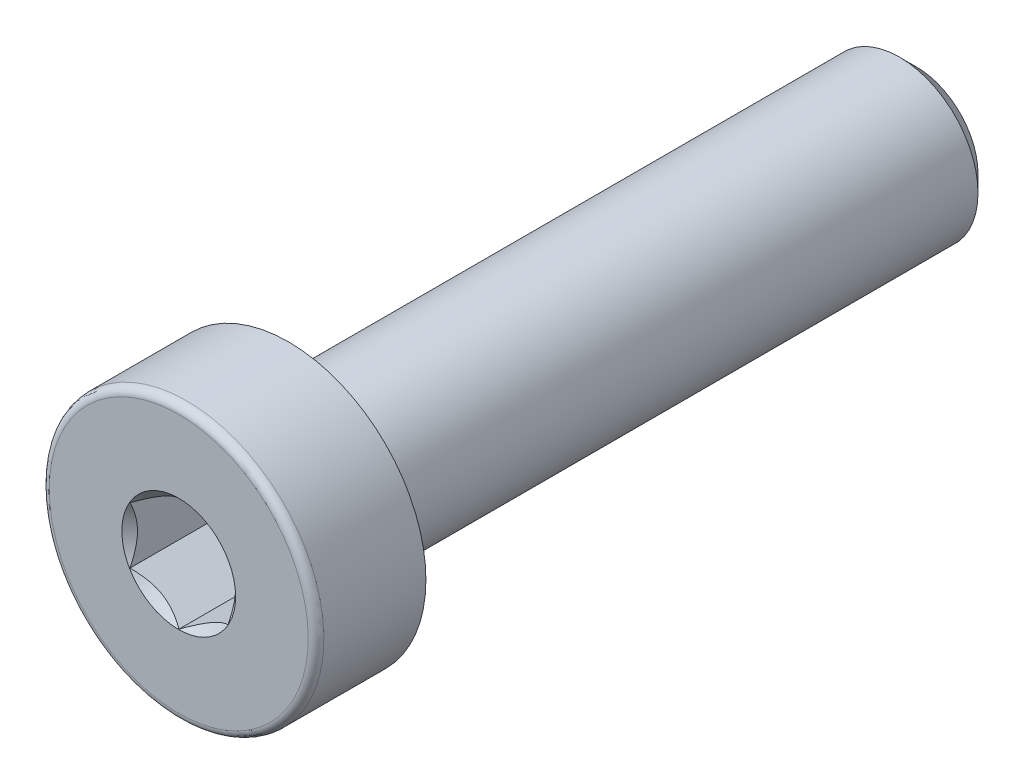
ISO-10303-21;
HEADER;
FILE_DESCRIPTION(('STEP AP214'),'2;1');
FILE_NAME('part.step','',(''),(''),'','','');
FILE_SCHEMA(('AUTOMOTIVE_DESIGN { 1 0 10303 214 1 1 1 1 }'));
ENDSEC;
DATA;
#1=APPLICATION_CONTEXT('core data for automotive mechanical design processes');
#2=APPLICATION_PROTOCOL_DEFINITION('international standard','automotive_design',2000,#1);
#3=PRODUCT_CONTEXT('',#1,'mechanical');
#4=PRODUCT('Part','Part','',(#3));
#5=PRODUCT_RELATED_PRODUCT_CATEGORY('part','',(#4));
#6=PRODUCT_DEFINITION_FORMATION('','',#4);
#7=PRODUCT_DEFINITION_CONTEXT('part definition',#1,'design');
#8=PRODUCT_DEFINITION('design','',#6,#7);
#9=PRODUCT_DEFINITION_SHAPE('','',#8);
#10=(LENGTH_UNIT() NAMED_UNIT(*) SI_UNIT(.MILLI.,.METRE.));
#11=(NAMED_UNIT(*) PLANE_ANGLE_UNIT() SI_UNIT($,.RADIAN.));
#12=(NAMED_UNIT(*) SI_UNIT($,.STERADIAN.) SOLID_ANGLE_UNIT());
#13=UNCERTAINTY_MEASURE_WITH_UNIT(LENGTH_MEASURE(1.E-05),#10,'distance_accuracy_value','');
#14=(GEOMETRIC_REPRESENTATION_CONTEXT(3) GLOBAL_UNCERTAINTY_ASSIGNED_CONTEXT((#13)) GLOBAL_UNIT_ASSIGNED_CONTEXT((#10,
#11,#12)) REPRESENTATION_CONTEXT('',''));
#15=CARTESIAN_POINT('',(0.,0.,0.));
#16=DIRECTION('',(0.,0.,1.));
#17=DIRECTION('',(1.,0.,0.));
#18=AXIS2_PLACEMENT_3D('',#15,#16,#17);
#19=CARTESIAN_POINT('',(12.1733937586588,8.47168783648703,11.6));
#20=DIRECTION('',(-1.,0.,0.));
#21=DIRECTION('',(0.,-1.,0.));
#22=AXIS2_PLACEMENT_3D('',#19,#20,#21);
#23=PLANE('',#22);
#24=DIRECTION('',(0.,0.,1.));
#25=VECTOR('',#24,1.);
#26=CARTESIAN_POINT('',(12.1733937586588,7.02831216351297,11.6));
#27=LINE('',#26,#25);
#28=CARTESIAN_POINT('',(12.1733936055537,7.02831205156453,11.5933758615089));
#29=VERTEX_POINT('',#28);
#30=CARTESIAN_POINT('',(12.1733937586588,7.02831216351297,9.3));
#31=VERTEX_POINT('',#30);
#32=EDGE_CURVE('E79',#29,#31,#27,.F.);
#33=ORIENTED_EDGE('',*,*,#32,.T.);
#34=DIRECTION('',(0.,-1.,0.));
#35=VECTOR('',#34,1.);
#36=CARTESIAN_POINT('',(12.1733937586588,8.47168783648703,9.3));
#37=LINE('',#36,#35);
#38=CARTESIAN_POINT('',(12.1733937586588,8.47168783648703,9.3));
#39=VERTEX_POINT('',#38);
#40=EDGE_CURVE('E85',#39,#31,#37,.T.);
#41=ORIENTED_EDGE('',*,*,#40,.F.);
#42=DIRECTION('',(0.,0.,1.));
#43=VECTOR('',#42,1.);
#44=CARTESIAN_POINT('',(12.1733937586588,8.47168783648703,11.6));
#45=LINE('',#44,#43);
#46=CARTESIAN_POINT('',(12.1733937586588,8.47168783649215,11.5933756729511));
#47=VERTEX_POINT('',#46);
#48=EDGE_CURVE('E82',#39,#47,#45,.T.);
#49=ORIENTED_EDGE('',*,*,#48,.T.);
#50=CARTESIAN_POINT('',(12.1733937331432,7.02831211077274,11.5933756853312));
#51=CARTESIAN_POINT('',(12.1733937494776,7.07792164231517,11.5685947292841));
#52=CARTESIAN_POINT('',(12.1733937561935,7.12836064770858,11.5452694390637));
#53=CARTESIAN_POINT('',(12.1733937611384,7.23121095441787,11.5025618251181));
#54=CARTESIAN_POINT('',(12.1733937593177,7.28363203145641,11.4832032561276));
#55=CARTESIAN_POINT('',(12.1733937580104,7.38933655588187,11.4500418936137));
#56=CARTESIAN_POINT('',(12.1733937584872,7.44259309812312,11.4361557728266));
#57=CARTESIAN_POINT('',(12.17339375883,7.55027832665406,11.4147615753697));
#58=CARTESIAN_POINT('',(12.1733937586975,7.60470372561001,11.4072375346613));
#59=CARTESIAN_POINT('',(12.1733937586311,7.69851085379618,11.4004485004952));
#60=CARTESIAN_POINT('',(12.1733937586514,7.73777152196755,11.3994438615368));
#61=CARTESIAN_POINT('',(12.1733937586662,7.81622375204068,11.4011391685543));
#62=CARTESIAN_POINT('',(12.1733937586608,7.85541529676245,11.4038399328631));
#63=CARTESIAN_POINT('',(12.1733937586568,7.93342000951447,11.4127899225568));
#64=CARTESIAN_POINT('',(12.1733937586583,7.9722327915118,11.4190424476048));
#65=CARTESIAN_POINT('',(12.1733937586593,8.04921033113919,11.4347592145066));
#66=CARTESIAN_POINT('',(12.173393758659,8.08737480331317,11.4442248344974));
#67=CARTESIAN_POINT('',(12.1733937586585,8.18507550237444,11.4723040074918));
#68=CARTESIAN_POINT('',(12.1733937586587,8.24399691925719,11.4930250205897));
#69=CARTESIAN_POINT('',(12.1733937586589,8.3595345412326,11.5396991802522));
#70=CARTESIAN_POINT('',(12.1733937586591,8.41615754724984,11.565635294969));
#71=CARTESIAN_POINT('',(12.1733937586588,8.47168783649727,11.5933756729536));
#72=B_SPLINE_CURVE_WITH_KNOTS('',3,(#50,#51,#52,#53,#54,#55,#56,#57,#58,#59,#60,#61,#62,#63,#64,
#65,#66,#67,#68,#69,#70,#71),.UNSPECIFIED.,.F.,.F.,(4,2,2,2,2,2,2,2,2,2,4),(0.,
0.166478697229374,0.333926955646074,0.498716702194594,0.663091712815436,0.780745635339157,
0.898425545737518,1.01621496255327,1.13405496470712,1.32111597483518,1.50757571066265),.UNSPECIFIED.);
#73=EDGE_CURVE('E76',#29,#47,#72,.T.);
#74=ORIENTED_EDGE('',*,*,#73,.F.);
#75=EDGE_LOOP('',(#33,#41,#49,#74));
#76=FACE_BOUND('',#75,.T.);
#77=ADVANCED_FACE('F16',(#76),#23,.F.);
#78=CARTESIAN_POINT('',(12.1733937586588,7.02831216351297,11.6));
#79=DIRECTION('',(-0.500000000000001,-0.866025403784438,0.));
#80=DIRECTION('',(0.866025403784438,-0.500000000000001,0.));
#81=AXIS2_PLACEMENT_3D('',#78,#79,#80);
#82=PLANE('',#81);
#83=DIRECTION('',(0.,0.,1.));
#84=VECTOR('',#83,1.);
#85=CARTESIAN_POINT('',(13.4233937586588,6.30662432702593,11.6));
#86=LINE('',#85,#84);
#87=CARTESIAN_POINT('',(13.4233937586588,6.30662432702081,11.5933756729536));
#88=VERTEX_POINT('',#87);
#89=CARTESIAN_POINT('',(13.4233937586588,6.30662432702593,9.3));
#90=VERTEX_POINT('',#89);
#91=EDGE_CURVE('E162',#88,#90,#86,.F.);
#92=ORIENTED_EDGE('',*,*,#91,.T.);
#93=DIRECTION('',(0.866025403784438,-0.500000000000001,0.));
#94=VECTOR('',#93,1.);
#95=CARTESIAN_POINT('',(12.1733937586588,7.02831216351297,9.3));
#96=LINE('',#95,#94);
#97=EDGE_CURVE('E96',#31,#90,#96,.T.);
#98=ORIENTED_EDGE('',*,*,#97,.F.);
#99=ORIENTED_EDGE('',*,*,#32,.F.);
#100=CARTESIAN_POINT('',(13.4233937586677,6.30662432702081,11.5933756729536));
#101=CARTESIAN_POINT('',(13.3804306501223,6.33142908930469,11.5685947126506));
#102=CARTESIAN_POINT('',(13.3367491945379,6.35664858944496,11.5452694223769));
#103=CARTESIAN_POINT('',(13.2476782239322,6.40807373830116,11.5025618117957));
#104=CARTESIAN_POINT('',(13.2022802428856,6.43428427487907,11.4832032462249));
#105=CARTESIAN_POINT('',(13.1107374469578,6.48713653275033,11.4500418887989));
#106=CARTESIAN_POINT('',(13.0646159326103,6.51376480147433,11.4361557696904));
#107=CARTESIAN_POINT('',(12.971357797428,6.56760741092591,11.4147615747397));
#108=CARTESIAN_POINT('',(12.9242240235054,6.59482010798808,11.4072375348733));
#109=CARTESIAN_POINT('',(12.8429846721375,6.64172366936909,11.4004485007569));
#110=CARTESIAN_POINT('',(12.8089839366087,6.66135400317931,11.3994438616172));
#111=CARTESIAN_POINT('',(12.7410423133172,6.70058011767586,11.401139168185));
#112=CARTESIAN_POINT('',(12.7071014404328,6.72017588977221,11.4038399322248));
#113=CARTESIAN_POINT('',(12.6395473783756,6.75917824568574,11.4127899213084));
#114=CARTESIAN_POINT('',(12.6059345235182,6.77858463648594,11.4190424460243));
#115=CARTESIAN_POINT('',(12.5392700193397,6.81707340591875,11.434759212224));
#116=CARTESIAN_POINT('',(12.506218617231,6.83615564182331,11.4442248318446));
#117=CARTESIAN_POINT('',(12.4216073208424,6.88500599656975,11.4723040071108));
#118=CARTESIAN_POINT('',(12.3705798679616,6.91446671022657,11.4930250241554));
#119=CARTESIAN_POINT('',(12.2705213349776,6.97223553117955,11.5396991933418));
#120=CARTESIAN_POINT('',(12.2214843650941,7.00054703894206,11.5656353136158));
#121=CARTESIAN_POINT('',(12.1733937160222,7.0283121881292,11.5933756975647));
#122=B_SPLINE_CURVE_WITH_KNOTS('',3,(#100,#101,#102,#103,#104,#105,#106,#107,#108,#109,#110,
#111,#112,#113,#114,#115,#116,#117,#118,#119,#120,#121),.UNSPECIFIED.,.F.,.F.,(4,2,2,2,2,2,2,2,
2,2,4),(0.,0.166478683382741,0.333926927146366,0.498716658706535,0.663091654692478,
0.78074557559468,0.898425484357227,1.01621489984312,1.13405490066788,1.32111594407947,
1.50757571257571),.UNSPECIFIED.);
#123=EDGE_CURVE('E88',#88,#29,#122,.T.);
#124=ORIENTED_EDGE('',*,*,#123,.F.);
#125=EDGE_LOOP('',(#92,#98,#99,#124));
#126=FACE_BOUND('',#125,.T.);
#127=ADVANCED_FACE('F98',(#126),#82,.F.);
#128=CARTESIAN_POINT('',(13.4233937586588,9.19337567297406,11.6));
#129=DIRECTION('',(-0.499999999999999,0.866025403784439,0.));
#130=DIRECTION('',(-0.866025403784439,-0.499999999999999,0.));
#131=AXIS2_PLACEMENT_3D('',#128,#129,#130);
#132=PLANE('',#131);
#133=ORIENTED_EDGE('',*,*,#48,.F.);
#134=DIRECTION('',(-0.86602540378444,-0.499999999999998,0.));
#135=VECTOR('',#134,1.);
#136=CARTESIAN_POINT('',(13.4233937586588,9.19337567297406,9.3));
#137=LINE('',#136,#135);
#138=CARTESIAN_POINT('',(13.4233937586588,9.19337567297406,9.3));
#139=VERTEX_POINT('',#138);
#140=EDGE_CURVE('E257',#139,#39,#137,.T.);
#141=ORIENTED_EDGE('',*,*,#140,.F.);
#142=DIRECTION('',(0.,0.,1.));
#143=VECTOR('',#142,1.);
#144=CARTESIAN_POINT('',(13.4233937586588,9.19337567297406,11.6));
#145=LINE('',#144,#143);
#146=CARTESIAN_POINT('',(13.4233937586632,9.19337567297662,11.5933756729511));
#147=VERTEX_POINT('',#146);
#148=EDGE_CURVE('E249',#139,#147,#145,.T.);
#149=ORIENTED_EDGE('',*,*,#148,.T.);
#150=CARTESIAN_POINT('',(12.1733937586499,8.47168783648191,11.5933756729536));
#151=CARTESIAN_POINT('',(12.2163568671591,8.49649259874491,11.5685947126715));
#152=CARTESIAN_POINT('',(12.260038322706,8.52171209886348,11.5452694224163));
#153=CARTESIAN_POINT('',(12.3491092932341,8.57313724767489,11.5025618118642));
#154=CARTESIAN_POINT('',(12.3945072742407,8.59934778422971,11.4832032463041));
#155=CARTESIAN_POINT('',(12.4860500701639,8.65220004209833,11.4500418888603));
#156=CARTESIAN_POINT('',(12.5321715845493,8.67882831084419,11.4361557697322));
#157=CARTESIAN_POINT('',(12.6254297198094,8.7326709203407,11.4147615747526));
#158=CARTESIAN_POINT('',(12.672563493772,8.75988361742592,11.4072375348767));
#159=CARTESIAN_POINT('',(12.7538028451942,8.80678717883836,11.4004485007558));
#160=CARTESIAN_POINT('',(12.7878035807373,8.8264175126568,11.3994438616164));
#161=CARTESIAN_POINT('',(12.8557452040574,8.86564362716982,11.401139168188));
#162=CARTESIAN_POINT('',(12.8896860769561,8.88523939927441,11.4038399322312));
#163=CARTESIAN_POINT('',(12.9572401390132,8.92424175518795,11.4127899213208));
#164=CARTESIAN_POINT('',(12.9908529938567,8.9436481459801,11.4190424460366));
#165=CARTESIAN_POINT('',(13.0575174980066,8.98213691539642,11.434759212232));
#166=CARTESIAN_POINT('',(13.0905689001008,9.00121915129258,11.4442248318486));
#167=CARTESIAN_POINT('',(13.1751801888192,9.05006950161066,11.4723040045711));
#168=CARTESIAN_POINT('',(13.2262076343048,9.07953021099782,11.4930250180483));
#169=CARTESIAN_POINT('',(13.3262661530795,9.13729902374711,11.5396991787867));
#170=CARTESIAN_POINT('',(13.3753031161464,9.16561052757401,11.5656352941876));
#171=CARTESIAN_POINT('',(13.4233937586677,9.19337567297918,11.5933756729536));
#172=B_SPLINE_CURVE_WITH_KNOTS('',3,(#150,#151,#152,#153,#154,#155,#156,#157,#158,#159,#160,
#161,#162,#163,#164,#165,#166,#167,#168,#169,#170,#171),.UNSPECIFIED.,.F.,.F.,(4,2,2,2,2,2,2,2,
2,2,4),(0.,0.166478683242098,0.333926926865393,0.49871665856662,0.663091654692319,
0.780745575643618,0.898425484455998,1.01621489989415,1.1340549006677,1.32111591649027,
1.50757565759361),.UNSPECIFIED.);
#173=EDGE_CURVE('E157',#47,#147,#172,.T.);
#174=ORIENTED_EDGE('',*,*,#173,.F.);
#175=EDGE_LOOP('',(#133,#141,#149,#174));
#176=FACE_BOUND('',#175,.T.);
#177=ADVANCED_FACE('F166',(#176),#132,.F.);
#178=CARTESIAN_POINT('',(13.4233937586588,6.30662432702593,11.6));
#179=DIRECTION('',(0.499999999999999,-0.866025403784439,0.));
#180=DIRECTION('',(0.866025403784439,0.499999999999999,0.));
#181=AXIS2_PLACEMENT_3D('',#178,#179,#180);
#182=PLANE('',#181);
#183=DIRECTION('',(0.,0.,1.));
#184=VECTOR('',#183,1.);
#185=CARTESIAN_POINT('',(14.6733937586588,7.02831216351297,11.6));
#186=LINE('',#185,#184);
#187=CARTESIAN_POINT('',(14.6733937586635,7.02831216351567,11.5933756729512));
#188=VERTEX_POINT('',#187);
#189=CARTESIAN_POINT('',(14.6733937586588,7.02831216351297,9.3));
#190=VERTEX_POINT('',#189);
#191=EDGE_CURVE('E245',#188,#190,#186,.F.);
#192=ORIENTED_EDGE('',*,*,#191,.T.);
#193=DIRECTION('',(0.866025403784436,0.500000000000004,0.));
#194=VECTOR('',#193,1.);
#195=CARTESIAN_POINT('',(13.4233937586588,6.30662432702593,9.3));
#196=LINE('',#195,#194);
#197=EDGE_CURVE('E263',#90,#190,#196,.T.);
#198=ORIENTED_EDGE('',*,*,#197,.F.);
#199=ORIENTED_EDGE('',*,*,#91,.F.);
#200=CARTESIAN_POINT('',(14.6733937586682,7.02831216351837,11.5933756729539));
#201=CARTESIAN_POINT('',(14.630430650159,7.00350740125535,11.5685947126717));
#202=CARTESIAN_POINT('',(14.5867491946121,6.97828790113677,11.5452694224165));
#203=CARTESIAN_POINT('',(14.4976782240839,6.92686275232532,11.5025618118644));
#204=CARTESIAN_POINT('',(14.4522802430772,6.90065221577048,11.4832032463042));
#205=CARTESIAN_POINT('',(14.360737447154,6.84779995790182,11.4500418888604));
#206=CARTESIAN_POINT('',(14.3146159327685,6.82117168915594,11.4361557697323));
#207=CARTESIAN_POINT('',(14.2213577975084,6.76732907965938,11.4147615747526));
#208=CARTESIAN_POINT('',(14.1742240235458,6.74011638257415,11.4072375348767));
#209=CARTESIAN_POINT('',(14.0929846721235,6.69321282116169,11.4004485007558));
#210=CARTESIAN_POINT('',(14.0589839365804,6.67358248734324,11.3994438616164));
#211=CARTESIAN_POINT('',(13.9910423132603,6.63435637283022,11.401139168188));
#212=CARTESIAN_POINT('',(13.9571014403616,6.61476060072563,11.4038399322312));
#213=CARTESIAN_POINT('',(13.8895473783045,6.57575824481208,11.4127899213208));
#214=CARTESIAN_POINT('',(13.855934523461,6.55635185401994,11.4190424460366));
#215=CARTESIAN_POINT('',(13.7892700193111,6.51786308460361,11.434759212232));
#216=CARTESIAN_POINT('',(13.7562186172169,6.49878084870746,11.4442248318486));
#217=CARTESIAN_POINT('',(13.6716073284984,6.44993049838936,11.4723040045711));
#218=CARTESIAN_POINT('',(13.6205798830129,6.4204697890022,11.4930250180483));
#219=CARTESIAN_POINT('',(13.5205213642381,6.3627009762529,11.5396991787867));
#220=CARTESIAN_POINT('',(13.4714844011712,6.33438947242599,11.5656352941876));
#221=CARTESIAN_POINT('',(13.4233937586499,6.30662432702081,11.5933756729536));
#222=B_SPLINE_CURVE_WITH_KNOTS('',3,(#200,#201,#202,#203,#204,#205,#206,#207,#208,#209,#210,
#211,#212,#213,#214,#215,#216,#217,#218,#219,#220,#221),.UNSPECIFIED.,.F.,.F.,(4,2,2,2,2,2,2,2,
2,2,4),(0.,0.166478683242231,0.333926926865661,0.498716658567027,0.663091654692855,
0.780745575644161,0.898425484456549,1.0162148998947,1.13405490066827,1.32111591649086,
1.50757565759425),.UNSPECIFIED.);
#223=EDGE_CURVE('E92',#188,#88,#222,.T.);
#224=ORIENTED_EDGE('',*,*,#223,.F.);
#225=EDGE_LOOP('',(#192,#198,#199,#224));
#226=FACE_BOUND('',#225,.T.);
#227=ADVANCED_FACE('F169',(#226),#182,.F.);
#228=CARTESIAN_POINT('',(13.4233937586588,7.75,9.3));
#229=DIRECTION('',(0.,0.,1.));
#230=DIRECTION('',(1.,0.,0.));
#231=AXIS2_PLACEMENT_3D('',#228,#229,#230);
#232=PLANE('',#231);
#233=DIRECTION('',(-0.866025403784438,0.500000000000001,0.));
#234=VECTOR('',#233,1.);
#235=CARTESIAN_POINT('',(14.6733937586588,8.47168783648703,9.3));
#236=LINE('',#235,#234);
#237=CARTESIAN_POINT('',(14.6733937586588,8.47168783648703,9.3));
#238=VERTEX_POINT('',#237);
#239=EDGE_CURVE('E252',#238,#139,#236,.T.);
#240=ORIENTED_EDGE('',*,*,#239,.T.);
#241=ORIENTED_EDGE('',*,*,#140,.T.);
#242=ORIENTED_EDGE('',*,*,#40,.T.);
#243=ORIENTED_EDGE('',*,*,#97,.T.);
#244=ORIENTED_EDGE('',*,*,#197,.T.);
#245=DIRECTION('',(0.,1.,0.));
#246=VECTOR('',#245,1.);
#247=CARTESIAN_POINT('',(14.6733937586588,7.02831216351297,9.3));
#248=LINE('',#247,#246);
#249=EDGE_CURVE('E242',#190,#238,#248,.T.);
#250=ORIENTED_EDGE('',*,*,#249,.T.);
#251=EDGE_LOOP('',(#240,#241,#242,#243,#244,#250));
#252=FACE_BOUND('',#251,.T.);
#253=ADVANCED_FACE('F275',(#252),#232,.T.);
#254=CARTESIAN_POINT('',(14.6733937586588,8.47168783648703,11.6));
#255=DIRECTION('',(0.500000000000001,0.866025403784438,0.));
#256=DIRECTION('',(-0.866025403784438,0.500000000000001,0.));
#257=AXIS2_PLACEMENT_3D('',#254,#255,#256);
#258=PLANE('',#257);
#259=ORIENTED_EDGE('',*,*,#148,.F.);
#260=ORIENTED_EDGE('',*,*,#239,.F.);
#261=DIRECTION('',(0.,0.,1.));
#262=VECTOR('',#261,1.);
#263=CARTESIAN_POINT('',(14.6733937586588,8.47168783648703,11.6));
#264=LINE('',#263,#262);
#265=CARTESIAN_POINT('',(14.6733937586261,8.47168783647076,11.5933756728862));
#266=VERTEX_POINT('',#265);
#267=EDGE_CURVE('E130',#238,#266,#264,.T.);
#268=ORIENTED_EDGE('',*,*,#267,.T.);
#269=CARTESIAN_POINT('',(13.4233937586499,9.19337567297918,11.5933756729536));
#270=CARTESIAN_POINT('',(13.4663568671591,9.16857091071619,11.5685947126715));
#271=CARTESIAN_POINT('',(13.5100383227059,9.14335141059763,11.5452694224163));
#272=CARTESIAN_POINT('',(13.5991092932341,9.09192626178623,11.5025618118643));
#273=CARTESIAN_POINT('',(13.6445072742407,9.06571572523141,11.4832032463041));
#274=CARTESIAN_POINT('',(13.7360500701638,9.0128634673628,11.4500418888603));
#275=CARTESIAN_POINT('',(13.7821715845493,8.98623519861693,11.4361557697322));
#276=CARTESIAN_POINT('',(13.8754297198094,8.9323925891204,11.4147615747526));
#277=CARTESIAN_POINT('',(13.9225634937719,8.90517989203518,11.4072375348767));
#278=CARTESIAN_POINT('',(14.0038028451942,8.85827633062274,11.4004485007558));
#279=CARTESIAN_POINT('',(14.0378035807373,8.83864599680429,11.3994438616164));
#280=CARTESIAN_POINT('',(14.1057452040574,8.79941988229126,11.401139168188));
#281=CARTESIAN_POINT('',(14.1396860769561,8.77982411018667,11.4038399322312));
#282=CARTESIAN_POINT('',(14.2072401390132,8.74082175427313,11.4127899213209));
#283=CARTESIAN_POINT('',(14.2408529938567,8.72141536348099,11.4190424460366));
#284=CARTESIAN_POINT('',(14.3075174980066,8.68292659406467,11.434759212232));
#285=CARTESIAN_POINT('',(14.3405689001008,8.66384435816851,11.4442248318486));
#286=CARTESIAN_POINT('',(14.4251801888169,8.61499400785176,11.4723040045704));
#287=CARTESIAN_POINT('',(14.4762076343003,8.58553329846589,11.4930250180465));
#288=CARTESIAN_POINT('',(14.5762661530707,8.52776448571907,11.5396991787824));
#289=CARTESIAN_POINT('',(14.6253031161355,8.49945298189335,11.5656352941818));
#290=CARTESIAN_POINT('',(14.6733937586548,8.47168783648931,11.5933756729462));
#291=B_SPLINE_CURVE_WITH_KNOTS('',3,(#269,#270,#271,#272,#273,#274,#275,#276,#277,#278,#279,
#280,#281,#282,#283,#284,#285,#286,#287,#288,#289,#290),.UNSPECIFIED.,.F.,.F.,(4,2,2,2,2,2,2,2,
2,2,4),(0.,0.166478683242052,0.333926926865305,0.498716658566577,0.663091654692312,
0.780745575643626,0.89842548445602,1.01621489989416,1.1340549006677,1.32111591648196,
1.50757565757707),.UNSPECIFIED.);
#292=EDGE_CURVE('E131',#147,#266,#291,.T.);
#293=ORIENTED_EDGE('',*,*,#292,.F.);
#294=EDGE_LOOP('',(#259,#260,#268,#293));
#295=FACE_BOUND('',#294,.T.);
#296=ADVANCED_FACE('F281',(#295),#258,.F.);
#297=CARTESIAN_POINT('',(14.6733937586588,7.02831216351297,11.6));
#298=DIRECTION('',(1.,0.,0.));
#299=DIRECTION('',(0.,1.,0.));
#300=AXIS2_PLACEMENT_3D('',#297,#298,#299);
#301=PLANE('',#300);
#302=ORIENTED_EDGE('',*,*,#267,.F.);
#303=ORIENTED_EDGE('',*,*,#249,.F.);
#304=ORIENTED_EDGE('',*,*,#191,.F.);
#305=CARTESIAN_POINT('',(14.6733937586559,7.02831216350279,11.5933756729552));
#306=CARTESIAN_POINT('',(14.6733937586578,7.07792168802833,11.5685947126722));
#307=CARTESIAN_POINT('',(14.6733937586585,7.12836068826523,11.5452694224167));
#308=CARTESIAN_POINT('',(14.6733937586591,7.23121098588778,11.5025618118644));
#309=CARTESIAN_POINT('',(14.6733937586589,7.28363205899736,11.4832032463044));
#310=CARTESIAN_POINT('',(14.6733937586587,7.38933657473442,11.4500418888606));
#311=CARTESIAN_POINT('',(14.6733937586588,7.44259311222603,11.4361557697325));
#312=CARTESIAN_POINT('',(14.6733937586588,7.55027833121885,11.4147615747528));
#313=CARTESIAN_POINT('',(14.6733937586588,7.60470372538919,11.4072375348769));
#314=CARTESIAN_POINT('',(14.6733937586588,7.69851084821393,11.4004485007558));
#315=CARTESIAN_POINT('',(14.6733937586588,7.73777151585079,11.3994438616164));
#316=CARTESIAN_POINT('',(14.6733937586588,7.81622374487676,11.4011391681879));
#317=CARTESIAN_POINT('',(14.6733937586588,7.8554152890859,11.4038399322311));
#318=CARTESIAN_POINT('',(14.6733937586588,7.93342000091292,11.4127899213206));
#319=CARTESIAN_POINT('',(14.6733937586588,7.97223278249718,11.4190424460362));
#320=CARTESIAN_POINT('',(14.6733937586588,8.04921032132978,11.4347592122316));
#321=CARTESIAN_POINT('',(14.6733937586588,8.08737479312207,11.4442248318481));
#322=CARTESIAN_POINT('',(14.6733937586588,8.18507549375701,11.4723040045701));
#323=CARTESIAN_POINT('',(14.6733937586588,8.24399691253014,11.4930250180467));
#324=CARTESIAN_POINT('',(14.6733937586588,8.35953453802646,11.5396991787839));
#325=CARTESIAN_POINT('',(14.6733937586588,8.41615754567918,11.565635294184));
#326=CARTESIAN_POINT('',(14.6733937586588,8.47168783648849,11.5933756729492));
#327=B_SPLINE_CURVE_WITH_KNOTS('',3,(#305,#306,#307,#308,#309,#310,#311,#312,#313,#314,#315,
#316,#317,#318,#319,#320,#321,#322,#323,#324,#325,#326),.UNSPECIFIED.,.F.,.F.,(4,2,2,2,2,2,2,2,
2,2,4),(0.,0.16647868324187,0.333926926864878,0.498716658565825,0.663091654691264,
0.780745575642454,0.898425484454722,1.01621489989276,1.1340549006662,1.3211159164849,
1.50757565758439),.UNSPECIFIED.);
#328=EDGE_CURVE('E122',#188,#266,#327,.T.);
#329=ORIENTED_EDGE('',*,*,#328,.T.);
#330=EDGE_LOOP('',(#302,#303,#304,#329));
#331=FACE_BOUND('',#330,.T.);
#332=ADVANCED_FACE('F137',(#331),#301,.F.);
#333=CARTESIAN_POINT('',(13.4233937586588,7.75,11.5999999998735));
#334=DIRECTION('',(0.,0.,1.));
#335=DIRECTION('',(1.,0.,0.));
#336=AXIS2_PLACEMENT_3D('',#333,#334,#335);
#337=CONICAL_SURFACE('',#336,1.44999999989988,0.785398163459877);
#338=ORIENTED_EDGE('',*,*,#123,.T.);
#339=ORIENTED_EDGE('',*,*,#73,.T.);
#340=ORIENTED_EDGE('',*,*,#173,.T.);
#341=ORIENTED_EDGE('',*,*,#292,.T.);
#342=ORIENTED_EDGE('',*,*,#328,.F.);
#343=ORIENTED_EDGE('',*,*,#223,.T.);
#344=EDGE_LOOP('',(#338,#339,#340,#341,#342,#343));
#345=FACE_BOUND('',#344,.T.);
#346=CARTESIAN_POINT('',(13.4233937586588,7.75,11.5999999999958));
#347=DIRECTION('',(0.,0.,1.));
#348=DIRECTION('',(1.,0.,0.));
#349=AXIS2_PLACEMENT_3D('',#346,#347,#348);
#350=CIRCLE('',#349,1.45000000002221);
#351=CARTESIAN_POINT('',(14.873393758681,7.75,11.5999999999958));
#352=VERTEX_POINT('',#351);
#353=EDGE_CURVE('E119',#352,#352,#350,.F.);
#354=ORIENTED_EDGE('',*,*,#353,.F.);
#355=EDGE_LOOP('',(#354));
#356=FACE_BOUND('',#355,.T.);
#357=ADVANCED_FACE('F89',(#345,#356),#337,.F.);
#358=CARTESIAN_POINT('',(15.4802040926468,8.9375,11.6));
#359=DIRECTION('',(0.,0.,1.));
#360=DIRECTION('',(1.,0.,0.));
#361=AXIS2_PLACEMENT_3D('',#358,#359,#360);
#362=PLANE('',#361);
#363=CARTESIAN_POINT('',(13.4233937586588,7.75,11.6));
#364=DIRECTION('',(0.,0.,-1.));
#365=DIRECTION('',(-0.866025403784435,-0.500000000000006,0.));
#366=AXIS2_PLACEMENT_3D('',#363,#364,#365);
#367=CIRCLE('',#366,3.29999999999996);
#368=CARTESIAN_POINT('',(10.5655099261702,6.09999999999998,11.6));
#369=VERTEX_POINT('',#368);
#370=CARTESIAN_POINT('',(16.2812775911475,9.4,11.6));
#371=VERTEX_POINT('',#370);
#372=EDGE_CURVE('E36',#369,#371,#367,.T.);
#373=ORIENTED_EDGE('',*,*,#372,.F.);
#374=CARTESIAN_POINT('',(13.4233937586588,7.75,11.6));
#375=DIRECTION('',(0.,0.,-1.));
#376=DIRECTION('',(0.866025403784439,0.5,0.));
#377=AXIS2_PLACEMENT_3D('',#374,#375,#376);
#378=CIRCLE('',#377,3.30000000000005);
#379=EDGE_CURVE('E223',#371,#369,#378,.T.);
#380=ORIENTED_EDGE('',*,*,#379,.F.);
#381=EDGE_LOOP('',(#373,#380));
#382=FACE_BOUND('',#381,.T.);
#383=ORIENTED_EDGE('',*,*,#353,.T.);
#384=EDGE_LOOP('',(#383));
#385=FACE_BOUND('',#384,.T.);
#386=ADVANCED_FACE('F142',(#382,#385),#362,.T.);
#387=CARTESIAN_POINT('',(13.4233937586588,7.75,11.4));
#388=DIRECTION('',(0.,0.,1.));
#389=DIRECTION('',(0.866025403784439,0.499999999999999,0.));
#390=AXIS2_PLACEMENT_3D('',#387,#388,#389);
#391=TOROIDAL_SURFACE('',#390,3.3,0.199999999999999);
#392=ORIENTED_EDGE('',*,*,#372,.T.);
#393=ORIENTED_EDGE('',*,*,#379,.T.);
#394=EDGE_LOOP('',(#392,#393));
#395=FACE_BOUND('',#394,.T.);
#396=CARTESIAN_POINT('',(13.4233937586588,7.75,11.4));
#397=DIRECTION('',(0.,0.,-1.));
#398=DIRECTION('',(-1.,0.,0.));
#399=AXIS2_PLACEMENT_3D('',#396,#397,#398);
#400=CIRCLE('',#399,3.5);
#401=CARTESIAN_POINT('',(9.9233937586588,7.75,11.4));
#402=VERTEX_POINT('',#401);
#403=EDGE_CURVE('E118',#402,#402,#400,.T.);
#404=ORIENTED_EDGE('',*,*,#403,.F.);
#405=EDGE_LOOP('',(#404));
#406=FACE_BOUND('',#405,.T.);
#407=ADVANCED_FACE('F202',(#395,#406),#391,.T.);
#408=CARTESIAN_POINT('',(14.1034402069805,8.142625,-7.2));
#409=DIRECTION('',(0.,0.,-1.));
#410=DIRECTION('',(-1.,0.,0.));
#411=AXIS2_PLACEMENT_3D('',#408,#409,#410);
#412=PLANE('',#411);
#413=CARTESIAN_POINT('',(13.4233937586588,7.75,-7.20000000001164));
#414=DIRECTION('',(0.,0.,1.));
#415=DIRECTION('',(1.,0.,0.));
#416=AXIS2_PLACEMENT_3D('',#413,#414,#415);
#417=CIRCLE('',#416,1.57050000002239);
#418=CARTESIAN_POINT('',(14.9938937586812,7.75,-7.20000000001164));
#419=VERTEX_POINT('',#418);
#420=EDGE_CURVE('E115',#419,#419,#417,.T.);
#421=ORIENTED_EDGE('',*,*,#420,.F.);
#422=EDGE_LOOP('',(#421));
#423=FACE_BOUND('',#422,.T.);
#424=ADVANCED_FACE('F199',(#423),#412,.T.);
#425=CARTESIAN_POINT('',(13.4233937586588,7.75,10.1));
#426=DIRECTION('',(0.,0.,-1.));
#427=DIRECTION('',(-1.,0.,0.));
#428=AXIS2_PLACEMENT_3D('',#425,#426,#427);
#429=CYLINDRICAL_SURFACE('',#428,3.5);
#430=ORIENTED_EDGE('',*,*,#403,.T.);
#431=EDGE_LOOP('',(#430));
#432=FACE_BOUND('',#431,.T.);
#433=CARTESIAN_POINT('',(13.4233937586588,7.75,8.8));
#434=DIRECTION('',(0.,0.,-1.));
#435=DIRECTION('',(-1.,0.,0.));
#436=AXIS2_PLACEMENT_3D('',#433,#434,#435);
#437=CIRCLE('',#436,3.5);
#438=CARTESIAN_POINT('',(9.9233937586588,7.75,8.8));
#439=VERTEX_POINT('',#438);
#440=EDGE_CURVE('E112',#439,#439,#437,.T.);
#441=ORIENTED_EDGE('',*,*,#440,.F.);
#442=EDGE_LOOP('',(#441));
#443=FACE_BOUND('',#442,.T.);
#444=ADVANCED_FACE('F195',(#432,#443),#429,.T.);
#445=CARTESIAN_POINT('',(13.4233937586588,7.75,-6.77050000012969));
#446=DIRECTION('',(0.,0.,1.));
#447=DIRECTION('',(1.,0.,0.));
#448=AXIS2_PLACEMENT_3D('',#445,#446,#447);
#449=CONICAL_SURFACE('',#448,1.99999999987353,0.785398163361583);
#450=ORIENTED_EDGE('',*,*,#420,.T.);
#451=EDGE_LOOP('',(#450));
#452=FACE_BOUND('',#451,.T.);
#453=CARTESIAN_POINT('',(13.4233937586588,7.75,-6.7705));
#454=DIRECTION('',(0.,0.,-1.));
#455=DIRECTION('',(-1.,0.,0.));
#456=AXIS2_PLACEMENT_3D('',#453,#454,#455);
#457=CIRCLE('',#456,2.);
#458=CARTESIAN_POINT('',(11.4233937586588,7.75,-6.7705));
#459=VERTEX_POINT('',#458);
#460=EDGE_CURVE('E28',#459,#459,#457,.F.);
#461=ORIENTED_EDGE('',*,*,#460,.F.);
#462=EDGE_LOOP('',(#461));
#463=FACE_BOUND('',#462,.T.);
#464=ADVANCED_FACE('F187',(#452,#463),#449,.T.);
#465=CARTESIAN_POINT('',(15.804963619066,9.125,8.8));
#466=DIRECTION('',(0.,0.,-1.));
#467=DIRECTION('',(-1.,0.,0.));
#468=AXIS2_PLACEMENT_3D('',#465,#466,#467);
#469=PLANE('',#468);
#470=CARTESIAN_POINT('',(13.4233937586588,7.75,8.8));
#471=DIRECTION('',(0.,0.,-1.));
#472=DIRECTION('',(-1.,0.,0.));
#473=AXIS2_PLACEMENT_3D('',#470,#471,#472);
#474=CIRCLE('',#473,2.);
#475=CARTESIAN_POINT('',(11.4233937586588,7.75,8.8));
#476=VERTEX_POINT('',#475);
#477=EDGE_CURVE('E11',#476,#476,#474,.T.);
#478=ORIENTED_EDGE('',*,*,#477,.F.);
#479=EDGE_LOOP('',(#478));
#480=FACE_BOUND('',#479,.T.);
#481=ORIENTED_EDGE('',*,*,#440,.T.);
#482=EDGE_LOOP('',(#481));
#483=FACE_BOUND('',#482,.T.);
#484=ADVANCED_FACE('F181',(#480,#483),#469,.T.);
#485=CARTESIAN_POINT('',(13.4233937586588,7.75,1.01475));
#486=DIRECTION('',(0.,0.,-1.));
#487=DIRECTION('',(-1.,0.,0.));
#488=AXIS2_PLACEMENT_3D('',#485,#486,#487);
#489=CYLINDRICAL_SURFACE('',#488,2.);
#490=ORIENTED_EDGE('',*,*,#460,.T.);
#491=EDGE_LOOP('',(#490));
#492=FACE_BOUND('',#491,.T.);
#493=ORIENTED_EDGE('',*,*,#477,.T.);
#494=EDGE_LOOP('',(#493));
#495=FACE_BOUND('',#494,.T.);
#496=ADVANCED_FACE('F179',(#492,#495),#489,.T.);
#497=CLOSED_SHELL('',(#77,#127,#177,#227,#253,#296,#332,#357,#386,#407,#424,#444,#464,#484,#496));
#498=MANIFOLD_SOLID_BREP('B1',#497);
#499=ADVANCED_BREP_SHAPE_REPRESENTATION('',(#18,#498),#14);
#500=SHAPE_DEFINITION_REPRESENTATION(#9,#499);
ENDSEC;
END-ISO-10303-21;
